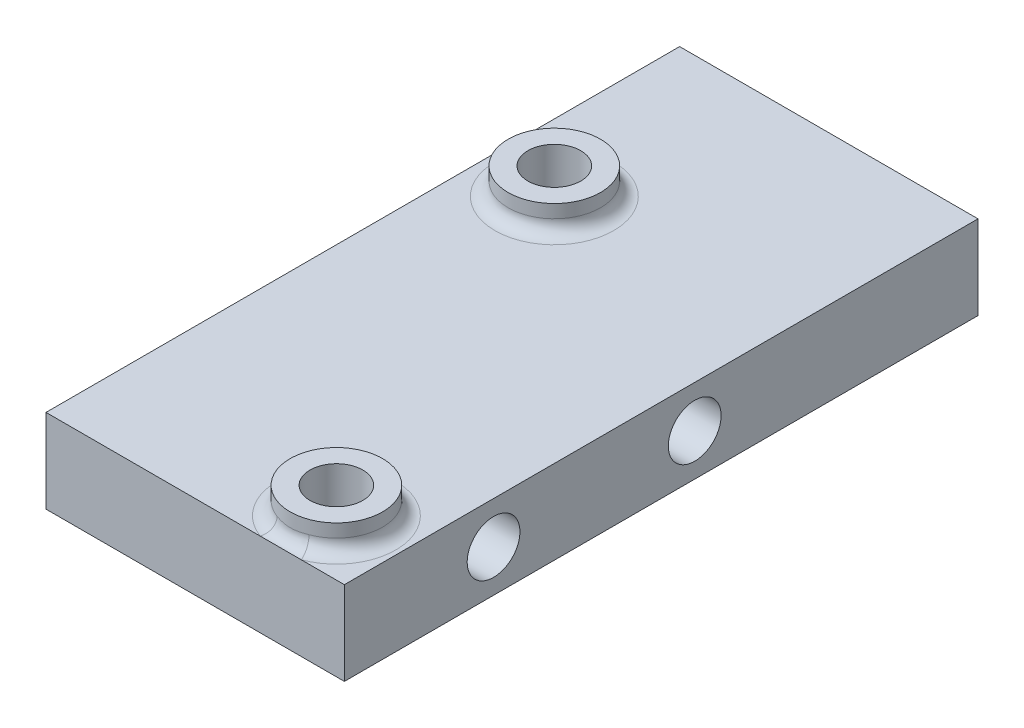
ISO-10303-21;
HEADER;
FILE_DESCRIPTION(('STEP AP214'),'2;1');
FILE_NAME('part.step','',(''),(''),'','','');
FILE_SCHEMA(('AUTOMOTIVE_DESIGN { 1 0 10303 214 1 1 1 1 }'));
ENDSEC;
DATA;
#1=APPLICATION_CONTEXT('core data for automotive mechanical design processes');
#2=APPLICATION_PROTOCOL_DEFINITION('international standard','automotive_design',2000,#1);
#3=PRODUCT_CONTEXT('',#1,'mechanical');
#4=PRODUCT('Part','Part','',(#3));
#5=PRODUCT_RELATED_PRODUCT_CATEGORY('part','',(#4));
#6=PRODUCT_DEFINITION_FORMATION('','',#4);
#7=PRODUCT_DEFINITION_CONTEXT('part definition',#1,'design');
#8=PRODUCT_DEFINITION('design','',#6,#7);
#9=PRODUCT_DEFINITION_SHAPE('','',#8);
#10=(LENGTH_UNIT() NAMED_UNIT(*) SI_UNIT(.MILLI.,.METRE.));
#11=(NAMED_UNIT(*) PLANE_ANGLE_UNIT() SI_UNIT($,.RADIAN.));
#12=(NAMED_UNIT(*) SI_UNIT($,.STERADIAN.) SOLID_ANGLE_UNIT());
#13=UNCERTAINTY_MEASURE_WITH_UNIT(LENGTH_MEASURE(1.E-05),#10,'distance_accuracy_value','');
#14=(GEOMETRIC_REPRESENTATION_CONTEXT(3) GLOBAL_UNCERTAINTY_ASSIGNED_CONTEXT((#13)) GLOBAL_UNIT_ASSIGNED_CONTEXT((#10,
#11,#12)) REPRESENTATION_CONTEXT('',''));
#15=CARTESIAN_POINT('',(0.,0.,0.));
#16=DIRECTION('',(0.,0.,1.));
#17=DIRECTION('',(1.,0.,0.));
#18=AXIS2_PLACEMENT_3D('',#15,#16,#17);
#19=CARTESIAN_POINT('',(0.,6.35,0.));
#20=DIRECTION('',(0.,1.,0.));
#21=DIRECTION('',(0.,0.,1.));
#22=AXIS2_PLACEMENT_3D('',#19,#20,#21);
#23=PLANE('',#22);
#24=CARTESIAN_POINT('',(5.207,6.35,-33.55975));
#25=DIRECTION('',(0.,1.,0.));
#26=DIRECTION('',(0.,0.,1.));
#27=AXIS2_PLACEMENT_3D('',#24,#25,#26);
#28=CIRCLE('',#27,4.5);
#29=CARTESIAN_POINT('',(5.207,6.35,-29.05975));
#30=VERTEX_POINT('',#29);
#31=EDGE_CURVE('E168',#30,#30,#28,.F.);
#32=ORIENTED_EDGE('',*,*,#31,.T.);
#33=EDGE_LOOP('',(#32));
#34=FACE_BOUND('',#33,.T.);
#35=DIRECTION('',(1.,0.,0.));
#36=VECTOR('',#35,1.);
#37=CARTESIAN_POINT('',(0.,6.35,-0.127));
#38=LINE('',#37,#36);
#39=CARTESIAN_POINT('',(0.127,6.35,-0.127));
#40=VERTEX_POINT('',#39);
#41=CARTESIAN_POINT('',(16.351885072575,6.35,-0.127));
#42=VERTEX_POINT('',#41);
#43=EDGE_CURVE('E121',#40,#42,#38,.T.);
#44=ORIENTED_EDGE('',*,*,#43,.T.);
#45=CARTESIAN_POINT('',(17.907,6.35,-4.34975));
#46=DIRECTION('',(0.,1.,0.));
#47=DIRECTION('',(0.,0.,1.));
#48=AXIS2_PLACEMENT_3D('',#45,#46,#47);
#49=CIRCLE('',#48,4.5);
#50=CARTESIAN_POINT('',(19.462114927425,6.35,-0.127));
#51=VERTEX_POINT('',#50);
#52=EDGE_CURVE('E60',#42,#51,#49,.F.);
#53=ORIENTED_EDGE('',*,*,#52,.T.);
#54=CARTESIAN_POINT('',(22.733,6.35,-0.127));
#55=VERTEX_POINT('',#54);
#56=EDGE_CURVE('E126',#51,#55,#38,.T.);
#57=ORIENTED_EDGE('',*,*,#56,.T.);
#58=DIRECTION('',(0.,0.,-1.));
#59=VECTOR('',#58,1.);
#60=CARTESIAN_POINT('',(22.733,6.35,0.));
#61=LINE('',#60,#59);
#62=CARTESIAN_POINT('',(22.733,6.35,-48.133));
#63=VERTEX_POINT('',#62);
#64=EDGE_CURVE('E124',#55,#63,#61,.T.);
#65=ORIENTED_EDGE('',*,*,#64,.T.);
#66=DIRECTION('',(1.,0.,0.));
#67=VECTOR('',#66,1.);
#68=CARTESIAN_POINT('',(0.,6.35,-48.133));
#69=LINE('',#68,#67);
#70=CARTESIAN_POINT('',(0.126999999999991,6.35,-48.133));
#71=VERTEX_POINT('',#70);
#72=EDGE_CURVE('E128',#71,#63,#69,.T.);
#73=ORIENTED_EDGE('',*,*,#72,.F.);
#74=DIRECTION('',(0.,0.,-1.));
#75=VECTOR('',#74,1.);
#76=CARTESIAN_POINT('',(0.127,6.35,0.));
#77=LINE('',#76,#75);
#78=EDGE_CURVE('E111',#40,#71,#77,.T.);
#79=ORIENTED_EDGE('',*,*,#78,.F.);
#80=EDGE_LOOP('',(#44,#53,#57,#65,#73,#79));
#81=FACE_BOUND('',#80,.T.);
#82=ADVANCED_FACE('F45',(#34,#81),#23,.T.);
#83=CARTESIAN_POINT('',(0.127,6.35,0.));
#84=DIRECTION('',(-1.,0.,0.));
#85=DIRECTION('',(0.,0.,1.));
#86=AXIS2_PLACEMENT_3D('',#83,#84,#85);
#87=PLANE('',#86);
#88=CARTESIAN_POINT('',(0.126999999999995,3.175,-26.67));
#89=DIRECTION('',(-1.,0.,0.));
#90=DIRECTION('',(0.,0.,1.));
#91=AXIS2_PLACEMENT_3D('',#88,#89,#90);
#92=CIRCLE('',#91,2.);
#93=CARTESIAN_POINT('',(0.126999999999996,3.175,-24.67));
#94=VERTEX_POINT('',#93);
#95=EDGE_CURVE('E224',#94,#94,#92,.T.);
#96=ORIENTED_EDGE('',*,*,#95,.F.);
#97=EDGE_LOOP('',(#96));
#98=FACE_BOUND('',#97,.T.);
#99=CARTESIAN_POINT('',(0.126999999999998,3.175,-11.43));
#100=DIRECTION('',(-1.,0.,0.));
#101=DIRECTION('',(0.,0.,1.));
#102=AXIS2_PLACEMENT_3D('',#99,#100,#101);
#103=CIRCLE('',#102,2.);
#104=CARTESIAN_POINT('',(0.126999999999998,3.175,-9.43));
#105=VERTEX_POINT('',#104);
#106=EDGE_CURVE('E216',#105,#105,#103,.T.);
#107=ORIENTED_EDGE('',*,*,#106,.F.);
#108=EDGE_LOOP('',(#107));
#109=FACE_BOUND('',#108,.T.);
#110=DIRECTION('',(0.,0.,-1.));
#111=VECTOR('',#110,1.);
#112=CARTESIAN_POINT('',(0.127,0.,0.));
#113=LINE('',#112,#111);
#114=CARTESIAN_POINT('',(0.127,0.,-0.127));
#115=VERTEX_POINT('',#114);
#116=CARTESIAN_POINT('',(0.126999999999991,0.,-48.133));
#117=VERTEX_POINT('',#116);
#118=EDGE_CURVE('E114',#115,#117,#113,.T.);
#119=ORIENTED_EDGE('',*,*,#118,.F.);
#120=DIRECTION('',(0.,-1.,0.));
#121=VECTOR('',#120,1.);
#122=CARTESIAN_POINT('',(0.127,6.35,-0.127));
#123=LINE('',#122,#121);
#124=EDGE_CURVE('E107',#40,#115,#123,.T.);
#125=ORIENTED_EDGE('',*,*,#124,.F.);
#126=ORIENTED_EDGE('',*,*,#78,.T.);
#127=DIRECTION('',(0.,-1.,0.));
#128=VECTOR('',#127,1.);
#129=CARTESIAN_POINT('',(0.126999999999991,6.35,-48.133));
#130=LINE('',#129,#128);
#131=EDGE_CURVE('E140',#71,#117,#130,.T.);
#132=ORIENTED_EDGE('',*,*,#131,.T.);
#133=EDGE_LOOP('',(#119,#125,#126,#132));
#134=FACE_BOUND('',#133,.T.);
#135=ADVANCED_FACE('F109',(#98,#109,#134),#87,.T.);
#136=CARTESIAN_POINT('',(0.,6.35,-0.127));
#137=DIRECTION('',(0.,0.,-1.));
#138=DIRECTION('',(-1.,0.,0.));
#139=AXIS2_PLACEMENT_3D('',#136,#137,#138);
#140=PLANE('',#139);
#141=DIRECTION('',(1.,0.,0.));
#142=VECTOR('',#141,1.);
#143=CARTESIAN_POINT('',(0.,0.,-0.127));
#144=LINE('',#143,#142);
#145=CARTESIAN_POINT('',(22.733,0.,-0.127));
#146=VERTEX_POINT('',#145);
#147=EDGE_CURVE('E142',#115,#146,#144,.T.);
#148=ORIENTED_EDGE('',*,*,#147,.T.);
#149=DIRECTION('',(0.,-1.,0.));
#150=VECTOR('',#149,1.);
#151=CARTESIAN_POINT('',(22.733,6.35,-0.127));
#152=LINE('',#151,#150);
#153=EDGE_CURVE('E118',#55,#146,#152,.T.);
#154=ORIENTED_EDGE('',*,*,#153,.F.);
#155=ORIENTED_EDGE('',*,*,#56,.F.);
#156=EDGE_CURVE('E123',#42,#51,#38,.T.);
#157=ORIENTED_EDGE('',*,*,#156,.F.);
#158=ORIENTED_EDGE('',*,*,#43,.F.);
#159=ORIENTED_EDGE('',*,*,#124,.T.);
#160=EDGE_LOOP('',(#148,#154,#155,#157,#158,#159));
#161=FACE_BOUND('',#160,.T.);
#162=ADVANCED_FACE('F122',(#161),#140,.F.);
#163=CARTESIAN_POINT('',(22.733,6.35,0.));
#164=DIRECTION('',(-1.,0.,0.));
#165=DIRECTION('',(0.,0.,1.));
#166=AXIS2_PLACEMENT_3D('',#163,#164,#165);
#167=PLANE('',#166);
#168=CARTESIAN_POINT('',(22.733,3.175,-26.67));
#169=DIRECTION('',(-1.,0.,0.));
#170=DIRECTION('',(0.,0.,1.));
#171=AXIS2_PLACEMENT_3D('',#168,#169,#170);
#172=CIRCLE('',#171,2.);
#173=CARTESIAN_POINT('',(22.733,3.175,-24.67));
#174=VERTEX_POINT('',#173);
#175=EDGE_CURVE('E143',#174,#174,#172,.T.);
#176=ORIENTED_EDGE('',*,*,#175,.T.);
#177=EDGE_LOOP('',(#176));
#178=FACE_BOUND('',#177,.T.);
#179=CARTESIAN_POINT('',(22.733,3.175,-11.43));
#180=DIRECTION('',(-1.,0.,0.));
#181=DIRECTION('',(0.,0.,1.));
#182=AXIS2_PLACEMENT_3D('',#179,#180,#181);
#183=CIRCLE('',#182,2.);
#184=CARTESIAN_POINT('',(22.733,3.175,-9.43000000000001));
#185=VERTEX_POINT('',#184);
#186=EDGE_CURVE('E135',#185,#185,#183,.T.);
#187=ORIENTED_EDGE('',*,*,#186,.T.);
#188=EDGE_LOOP('',(#187));
#189=FACE_BOUND('',#188,.T.);
#190=DIRECTION('',(0.,0.,-1.));
#191=VECTOR('',#190,1.);
#192=CARTESIAN_POINT('',(22.733,0.,0.));
#193=LINE('',#192,#191);
#194=CARTESIAN_POINT('',(22.733,0.,-48.133));
#195=VERTEX_POINT('',#194);
#196=EDGE_CURVE('E145',#146,#195,#193,.T.);
#197=ORIENTED_EDGE('',*,*,#196,.T.);
#198=DIRECTION('',(0.,-1.,0.));
#199=VECTOR('',#198,1.);
#200=CARTESIAN_POINT('',(22.733,6.35,-48.133));
#201=LINE('',#200,#199);
#202=EDGE_CURVE('E154',#63,#195,#201,.T.);
#203=ORIENTED_EDGE('',*,*,#202,.F.);
#204=ORIENTED_EDGE('',*,*,#64,.F.);
#205=ORIENTED_EDGE('',*,*,#153,.T.);
#206=EDGE_LOOP('',(#197,#203,#204,#205));
#207=FACE_BOUND('',#206,.T.);
#208=ADVANCED_FACE('F238',(#178,#189,#207),#167,.F.);
#209=CARTESIAN_POINT('',(17.907,6.35,-4.34975));
#210=DIRECTION('',(0.,-1.,0.));
#211=DIRECTION('',(0.,0.,-1.));
#212=AXIS2_PLACEMENT_3D('',#209,#210,#211);
#213=CYLINDRICAL_SURFACE('',#212,2.);
#214=CARTESIAN_POINT('',(17.907,0.,-4.34975));
#215=DIRECTION('',(0.,1.,0.));
#216=DIRECTION('',(0.,0.,1.));
#217=AXIS2_PLACEMENT_3D('',#214,#215,#216);
#218=CIRCLE('',#217,2.);
#219=CARTESIAN_POINT('',(17.907,0.,-2.34975));
#220=VERTEX_POINT('',#219);
#221=EDGE_CURVE('E132',#220,#220,#218,.T.);
#222=ORIENTED_EDGE('',*,*,#221,.F.);
#223=EDGE_LOOP('',(#222));
#224=FACE_BOUND('',#223,.T.);
#225=CARTESIAN_POINT('',(17.907,8.35,-4.34975));
#226=DIRECTION('',(0.,1.,0.));
#227=DIRECTION('',(0.,0.,1.));
#228=AXIS2_PLACEMENT_3D('',#225,#226,#227);
#229=CIRCLE('',#228,2.);
#230=CARTESIAN_POINT('',(17.907,8.35,-2.34975));
#231=VERTEX_POINT('',#230);
#232=EDGE_CURVE('E218',#231,#231,#229,.T.);
#233=ORIENTED_EDGE('',*,*,#232,.T.);
#234=EDGE_LOOP('',(#233));
#235=FACE_BOUND('',#234,.T.);
#236=ADVANCED_FACE('F268',(#224,#235),#213,.F.);
#237=CARTESIAN_POINT('',(0.,6.35,-48.133));
#238=DIRECTION('',(0.,0.,-1.));
#239=DIRECTION('',(-1.,0.,0.));
#240=AXIS2_PLACEMENT_3D('',#237,#238,#239);
#241=PLANE('',#240);
#242=DIRECTION('',(1.,0.,0.));
#243=VECTOR('',#242,1.);
#244=CARTESIAN_POINT('',(0.,0.,-48.133));
#245=LINE('',#244,#243);
#246=EDGE_CURVE('E148',#117,#195,#245,.T.);
#247=ORIENTED_EDGE('',*,*,#246,.F.);
#248=ORIENTED_EDGE('',*,*,#131,.F.);
#249=ORIENTED_EDGE('',*,*,#72,.T.);
#250=ORIENTED_EDGE('',*,*,#202,.T.);
#251=EDGE_LOOP('',(#247,#248,#249,#250));
#252=FACE_BOUND('',#251,.T.);
#253=ADVANCED_FACE('F269',(#252),#241,.T.);
#254=CARTESIAN_POINT('',(5.207,6.35,-33.55975));
#255=DIRECTION('',(0.,-1.,0.));
#256=DIRECTION('',(0.,0.,-1.));
#257=AXIS2_PLACEMENT_3D('',#254,#255,#256);
#258=CYLINDRICAL_SURFACE('',#257,2.);
#259=CARTESIAN_POINT('',(5.207,0.,-33.55975));
#260=DIRECTION('',(0.,1.,0.));
#261=DIRECTION('',(0.,0.,1.));
#262=AXIS2_PLACEMENT_3D('',#259,#260,#261);
#263=CIRCLE('',#262,2.);
#264=CARTESIAN_POINT('',(5.207,0.,-31.55975));
#265=VERTEX_POINT('',#264);
#266=EDGE_CURVE('E129',#265,#265,#263,.T.);
#267=ORIENTED_EDGE('',*,*,#266,.F.);
#268=EDGE_LOOP('',(#267));
#269=FACE_BOUND('',#268,.T.);
#270=CARTESIAN_POINT('',(5.207,8.35,-33.55975));
#271=DIRECTION('',(0.,1.,0.));
#272=DIRECTION('',(0.,0.,1.));
#273=AXIS2_PLACEMENT_3D('',#270,#271,#272);
#274=CIRCLE('',#273,2.);
#275=CARTESIAN_POINT('',(5.207,8.35,-31.55975));
#276=VERTEX_POINT('',#275);
#277=EDGE_CURVE('E213',#276,#276,#274,.T.);
#278=ORIENTED_EDGE('',*,*,#277,.T.);
#279=EDGE_LOOP('',(#278));
#280=FACE_BOUND('',#279,.T.);
#281=ADVANCED_FACE('F276',(#269,#280),#258,.F.);
#282=CARTESIAN_POINT('',(0.,0.,0.));
#283=DIRECTION('',(0.,1.,0.));
#284=DIRECTION('',(0.,0.,1.));
#285=AXIS2_PLACEMENT_3D('',#282,#283,#284);
#286=PLANE('',#285);
#287=ORIENTED_EDGE('',*,*,#118,.T.);
#288=ORIENTED_EDGE('',*,*,#246,.T.);
#289=ORIENTED_EDGE('',*,*,#196,.F.);
#290=ORIENTED_EDGE('',*,*,#147,.F.);
#291=EDGE_LOOP('',(#287,#288,#289,#290));
#292=FACE_BOUND('',#291,.T.);
#293=ORIENTED_EDGE('',*,*,#221,.T.);
#294=EDGE_LOOP('',(#293));
#295=FACE_BOUND('',#294,.T.);
#296=ORIENTED_EDGE('',*,*,#266,.T.);
#297=EDGE_LOOP('',(#296));
#298=FACE_BOUND('',#297,.T.);
#299=ADVANCED_FACE('F252',(#292,#295,#298),#286,.F.);
#300=CARTESIAN_POINT('',(22.733,3.175,-11.43));
#301=DIRECTION('',(-1.,0.,0.));
#302=DIRECTION('',(0.,0.,1.));
#303=AXIS2_PLACEMENT_3D('',#300,#301,#302);
#304=CYLINDRICAL_SURFACE('',#303,2.);
#305=ORIENTED_EDGE('',*,*,#186,.F.);
#306=EDGE_LOOP('',(#305));
#307=FACE_BOUND('',#306,.T.);
#308=ORIENTED_EDGE('',*,*,#106,.T.);
#309=EDGE_LOOP('',(#308));
#310=FACE_BOUND('',#309,.T.);
#311=ADVANCED_FACE('F229',(#307,#310),#304,.F.);
#312=CARTESIAN_POINT('',(22.733,3.175,-26.67));
#313=DIRECTION('',(-1.,0.,0.));
#314=DIRECTION('',(0.,0.,1.));
#315=AXIS2_PLACEMENT_3D('',#312,#313,#314);
#316=CYLINDRICAL_SURFACE('',#315,2.);
#317=ORIENTED_EDGE('',*,*,#175,.F.);
#318=EDGE_LOOP('',(#317));
#319=FACE_BOUND('',#318,.T.);
#320=ORIENTED_EDGE('',*,*,#95,.T.);
#321=EDGE_LOOP('',(#320));
#322=FACE_BOUND('',#321,.T.);
#323=ADVANCED_FACE('F242',(#319,#322),#316,.F.);
#324=CARTESIAN_POINT('',(5.207,8.35,-33.55975));
#325=DIRECTION('',(0.,1.,0.));
#326=DIRECTION('',(0.,0.,1.));
#327=AXIS2_PLACEMENT_3D('',#324,#325,#326);
#328=PLANE('',#327);
#329=CARTESIAN_POINT('',(5.207,8.35,-33.55975));
#330=DIRECTION('',(0.,1.,0.));
#331=DIRECTION('',(0.,0.,1.));
#332=AXIS2_PLACEMENT_3D('',#329,#330,#331);
#333=CIRCLE('',#332,3.5);
#334=CARTESIAN_POINT('',(5.207,8.35,-30.05975));
#335=VERTEX_POINT('',#334);
#336=EDGE_CURVE('E211',#335,#335,#333,.T.);
#337=ORIENTED_EDGE('',*,*,#336,.T.);
#338=EDGE_LOOP('',(#337));
#339=FACE_BOUND('',#338,.T.);
#340=ORIENTED_EDGE('',*,*,#277,.F.);
#341=EDGE_LOOP('',(#340));
#342=FACE_BOUND('',#341,.T.);
#343=ADVANCED_FACE('F207',(#339,#342),#328,.T.);
#344=CARTESIAN_POINT('',(5.207,8.35,-33.55975));
#345=DIRECTION('',(0.,-1.,0.));
#346=DIRECTION('',(0.,0.,-1.));
#347=AXIS2_PLACEMENT_3D('',#344,#345,#346);
#348=CYLINDRICAL_SURFACE('',#347,3.5);
#349=CARTESIAN_POINT('',(5.207,7.35,-33.55975));
#350=DIRECTION('',(0.,1.,0.));
#351=DIRECTION('',(0.,0.,1.));
#352=AXIS2_PLACEMENT_3D('',#349,#350,#351);
#353=CIRCLE('',#352,3.5);
#354=CARTESIAN_POINT('',(5.207,7.35,-30.05975));
#355=VERTEX_POINT('',#354);
#356=EDGE_CURVE('E11',#355,#355,#353,.T.);
#357=ORIENTED_EDGE('',*,*,#356,.T.);
#358=EDGE_LOOP('',(#357));
#359=FACE_BOUND('',#358,.T.);
#360=ORIENTED_EDGE('',*,*,#336,.F.);
#361=EDGE_LOOP('',(#360));
#362=FACE_BOUND('',#361,.T.);
#363=ADVANCED_FACE('F203',(#359,#362),#348,.T.);
#364=CARTESIAN_POINT('',(17.907,8.35,-4.34975));
#365=DIRECTION('',(0.,1.,0.));
#366=DIRECTION('',(0.,0.,1.));
#367=AXIS2_PLACEMENT_3D('',#364,#365,#366);
#368=PLANE('',#367);
#369=CARTESIAN_POINT('',(17.907,8.35,-4.34975));
#370=DIRECTION('',(0.,1.,0.));
#371=DIRECTION('',(0.,0.,1.));
#372=AXIS2_PLACEMENT_3D('',#369,#370,#371);
#373=CIRCLE('',#372,3.5);
#374=CARTESIAN_POINT('',(17.907,8.35,-0.849749999999997));
#375=VERTEX_POINT('',#374);
#376=EDGE_CURVE('E193',#375,#375,#373,.T.);
#377=ORIENTED_EDGE('',*,*,#376,.T.);
#378=EDGE_LOOP('',(#377));
#379=FACE_BOUND('',#378,.T.);
#380=ORIENTED_EDGE('',*,*,#232,.F.);
#381=EDGE_LOOP('',(#380));
#382=FACE_BOUND('',#381,.T.);
#383=ADVANCED_FACE('F206',(#379,#382),#368,.T.);
#384=CARTESIAN_POINT('',(17.907,8.35,-4.34975));
#385=DIRECTION('',(0.,-1.,0.));
#386=DIRECTION('',(0.,0.,-1.));
#387=AXIS2_PLACEMENT_3D('',#384,#385,#386);
#388=CYLINDRICAL_SURFACE('',#387,3.5);
#389=CARTESIAN_POINT('',(17.907,7.35,-4.34975));
#390=DIRECTION('',(0.,1.,0.));
#391=DIRECTION('',(0.,0.,1.));
#392=AXIS2_PLACEMENT_3D('',#389,#390,#391);
#393=CIRCLE('',#392,3.5);
#394=CARTESIAN_POINT('',(19.1165338324417,7.35,-1.06538888888889));
#395=VERTEX_POINT('',#394);
#396=CARTESIAN_POINT('',(16.6974661675583,7.35,-1.06538888888889));
#397=VERTEX_POINT('',#396);
#398=EDGE_CURVE('E117',#395,#397,#393,.T.);
#399=ORIENTED_EDGE('',*,*,#398,.T.);
#400=CARTESIAN_POINT('',(15.999697926745,7.24321872944896,-1.41509519894464));
#401=CARTESIAN_POINT('',(16.3294576607969,5.80948965724298,-1.2007764912701));
#402=CARTESIAN_POINT('',(15.4547544772436,6.35,-0.127));
#403=CARTESIAN_POINT('',(16.0433975283235,7.26155633603338,-1.38667642643534));
#404=CARTESIAN_POINT('',(16.3277106847959,5.85961918437073,-1.2086767850074));
#405=CARTESIAN_POINT('',(15.5109396791709,6.35,-0.127));
#406=CARTESIAN_POINT('',(16.0882379079662,7.27676005500093,-1.35893893439116));
#407=CARTESIAN_POINT('',(16.3337968310106,5.90877428258155,-1.21022918435183));
#408=CARTESIAN_POINT('',(15.5685915958453,6.35,-0.127));
#409=CARTESIAN_POINT('',(16.1796763203547,7.3019900220726,-1.30522546163517));
#410=CARTESIAN_POINT('',(16.3588848129907,6.00089432264958,-1.20419366238499));
#411=CARTESIAN_POINT('',(15.6861552689582,6.35,-0.127));
#412=CARTESIAN_POINT('',(16.2262698186064,7.31202875808702,-1.27924536537503));
#413=CARTESIAN_POINT('',(16.3774047065049,6.04420056046997,-1.19695922064592));
#414=CARTESIAN_POINT('',(15.7460611953328,6.35,-0.127));
#415=CARTESIAN_POINT('',(16.3206022029555,7.32804552092679,-1.22946512411143));
#416=CARTESIAN_POINT('',(16.4241427483341,6.12350666537659,-1.177264720906));
#417=CARTESIAN_POINT('',(15.8673456895324,6.35,-0.127));
#418=CARTESIAN_POINT('',(16.3683317816887,7.33404927937305,-1.2056520191199));
#419=CARTESIAN_POINT('',(16.4520350369096,6.15987474404767,-1.16498612475311));
#420=CARTESIAN_POINT('',(15.9287122907468,6.35,-0.127));
#421=CARTESIAN_POINT('',(16.4650023992085,7.34299012276124,-1.16015780249474));
#422=CARTESIAN_POINT('',(16.5152283263764,6.2260658127033,-1.13775889322251));
#423=CARTESIAN_POINT('',(16.0530030846908,6.35,-0.127));
#424=CARTESIAN_POINT('',(16.5139443818133,7.3459247364343,-1.13847842163442));
#425=CARTESIAN_POINT('',(16.5504092350124,6.25616254868961,-1.12284741984191));
#426=CARTESIAN_POINT('',(16.1159284909008,6.35,-0.127));
#427=CARTESIAN_POINT('',(16.649249127931,7.35082748837113,-1.08222712208977));
#428=CARTESIAN_POINT('',(16.653512220511,6.32970705651208,-1.08124457847469));
#429=CARTESIAN_POINT('',(16.2898917359147,6.35,-0.127));
#430=CARTESIAN_POINT('',(16.7366122759026,7.35049011088717,-1.04992620515135));
#431=CARTESIAN_POINT('',(16.7280006549486,6.368745571691,-1.05320476940297));
#432=CARTESIAN_POINT('',(16.4022157833042,6.35,-0.127));
#433=CARTESIAN_POINT('',(16.9135828006579,7.34627409552643,-0.992401102045088));
#434=CARTESIAN_POINT('',(16.8877770893521,6.43261282671311,-1.00032532935642));
#435=CARTESIAN_POINT('',(16.6297493151305,6.35,-0.127));
#436=CARTESIAN_POINT('',(17.0031910558094,7.34239404990394,-0.967179734278355));
#437=CARTESIAN_POINT('',(16.9733617913917,6.45816036139918,-0.975168037422289));
#438=CARTESIAN_POINT('',(16.7449599288976,6.35,-0.127));
#439=CARTESIAN_POINT('',(17.1844150701297,7.33371531003257,-0.923881160468167));
#440=CARTESIAN_POINT('',(17.1515023314267,6.49892667923025,-0.930901480346923));
#441=CARTESIAN_POINT('',(16.9779622330241,6.35,-0.127));
#442=CARTESIAN_POINT('',(17.2760366271477,7.32891353199229,-0.905828579093276));
#443=CARTESIAN_POINT('',(17.244640321304,6.51452413389724,-0.911487401873235));
#444=CARTESIAN_POINT('',(17.0957613777613,6.35,-0.127));
#445=CARTESIAN_POINT('',(17.4604424482232,7.32044074537923,-0.877100835900574));
#446=CARTESIAN_POINT('',(17.4346345868489,6.53805942666349,-0.880365706393962));
#447=CARTESIAN_POINT('',(17.3328545762868,6.35,-0.127));
#448=CARTESIAN_POINT('',(17.5532264569583,7.31676949287541,-0.866424081997488));
#449=CARTESIAN_POINT('',(17.5321865230427,6.54621088469009,-0.868413626543086));
#450=CARTESIAN_POINT('',(17.4521483018035,6.35,-0.127));
#451=CARTESIAN_POINT('',(17.7422140396949,7.31179018382034,-0.852309204932778));
#452=CARTESIAN_POINT('',(17.7315386979432,6.55674033265935,-0.852679067246822));
#453=CARTESIAN_POINT('',(17.6951323367506,6.35,-0.127));
#454=CARTESIAN_POINT('',(17.838436142061,7.31055698552848,-0.849099857322103));
#455=CARTESIAN_POINT('',(17.834232927626,6.55902893966175,-0.849019727085348));
#456=CARTESIAN_POINT('',(17.8188464683642,6.35,-0.127));
#457=CARTESIAN_POINT('',(18.0308195447798,7.31111953102721,-0.850618231134204));
#458=CARTESIAN_POINT('',(18.0385311221073,6.55792959830373,-0.850726094075816));
#459=CARTESIAN_POINT('',(18.0661965575739,6.35,-0.127));
#460=CARTESIAN_POINT('',(18.1269808392668,7.31291553237697,-0.855346627467324));
#461=CARTESIAN_POINT('',(18.1410032712376,6.554531869191,-0.856107175094256));
#462=CARTESIAN_POINT('',(18.1898325076286,6.35,-0.127));
#463=CARTESIAN_POINT('',(18.3184620483269,7.31889057201906,-0.872691554377935));
#464=CARTESIAN_POINT('',(18.3423628262768,6.54141108734868,-0.875370703909162));
#465=CARTESIAN_POINT('',(18.4360226335632,6.35,-0.127));
#466=CARTESIAN_POINT('',(18.4137825494985,7.32306778892083,-0.885302056647016));
#467=CARTESIAN_POINT('',(18.4420849593019,6.53157679651971,-0.889409662002608));
#468=CARTESIAN_POINT('',(18.5585775636411,6.35,-0.127));
#469=CARTESIAN_POINT('',(18.6030465951768,7.33219842827542,-0.918314965176124));
#470=CARTESIAN_POINT('',(18.6354814803517,6.50375232645859,-0.924816771487348));
#471=CARTESIAN_POINT('',(18.8019170509416,6.35,-0.127));
#472=CARTESIAN_POINT('',(18.6969901244687,7.33715185929795,-0.938717457466353));
#473=CARTESIAN_POINT('',(18.7298886133038,6.48548949782955,-0.946475378269153));
#474=CARTESIAN_POINT('',(18.9227015886021,6.35,-0.127));
#475=CARTESIAN_POINT('',(18.8577696618529,7.3443073678771,-0.980632871330693));
#476=CARTESIAN_POINT('',(18.8846443465066,6.44454445974384,-0.988250953538482));
#477=CARTESIAN_POINT('',(19.1294181366684,6.35,-0.127));
#478=CARTESIAN_POINT('',(18.925066999975,7.34689123480087,-1.00035390721988));
#479=CARTESIAN_POINT('',(18.9479707045128,6.42404459090778,-1.00747943116209));
#480=CARTESIAN_POINT('',(19.2159432856834,6.35,-0.127));
#481=CARTESIAN_POINT('',(19.0583449490239,7.35000523285223,-1.04379848382673));
#482=CARTESIAN_POINT('',(19.0681436278302,6.37574965221625,-1.04734161374027));
#483=CARTESIAN_POINT('',(19.387300648744,6.35,-0.127));
#484=CARTESIAN_POINT('',(19.12432641309,7.35053674073197,-1.06751933026192));
#485=CARTESIAN_POINT('',(19.1251175136652,6.34765057523598,-1.06810834099442));
#486=CARTESIAN_POINT('',(19.4721339596831,6.35,-0.127));
#487=CARTESIAN_POINT('',(19.2547574753592,7.34818383042843,-1.11889041714433));
#488=CARTESIAN_POINT('',(19.2303986466411,6.28252499742807,-1.10901077085189));
#489=CARTESIAN_POINT('',(19.6398310397517,6.35,-0.127));
#490=CARTESIAN_POINT('',(19.3192065354104,7.34529822977911,-1.14654201488563));
#491=CARTESIAN_POINT('',(19.2786803261878,6.24504352887782,-1.12922668792604));
#492=CARTESIAN_POINT('',(19.7226941169717,6.35,-0.127));
#493=CARTESIAN_POINT('',(19.4462267893442,7.33434856340773,-1.20559306318015));
#494=CARTESIAN_POINT('',(19.3634393064996,6.16005038598769,-1.16550955239314));
#495=CARTESIAN_POINT('',(19.8860058720387,6.35,-0.127));
#496=CARTESIAN_POINT('',(19.5087941322648,7.32627454652852,-1.23699962116552));
#497=CARTESIAN_POINT('',(19.3996268087809,6.11191555369393,-1.18149022656211));
#498=CARTESIAN_POINT('',(19.9664495986489,6.35,-0.127));
#499=CARTESIAN_POINT('',(19.5701341720201,7.31472651756466,-1.27014211491805));
#500=CARTESIAN_POINT('',(19.4268844482308,6.05917029230527,-1.19278047679505));
#501=CARTESIAN_POINT('',(20.0453153640259,6.35,-0.127));
#502=(BOUNDED_SURFACE() B_SPLINE_SURFACE(3,2,((#400,#401,#402),(#403,#404,#405),(#406,#407,
#408),(#409,#410,#411),(#412,#413,#414),(#415,#416,#417),(#418,#419,#420),(#421,#422,#423),
(#424,#425,#426),(#427,#428,#429),(#430,#431,#432),(#433,#434,#435),(#436,#437,#438),(#439,#440,
#441),(#442,#443,#444),(#445,#446,#447),(#448,#449,#450),(#451,#452,#453),(#454,#455,#456),
(#457,#458,#459),(#460,#461,#462),(#463,#464,#465),(#466,#467,#468),(#469,#470,#471),(#472,#473,
#474),(#475,#476,#477),(#478,#479,#480),(#481,#482,#483),(#484,#485,#486),(#487,#488,#489),
(#490,#491,#492),(#493,#494,#495),(#496,#497,#498),(#499,#500,#501)),.UNSPECIFIED.,.F.,.F.,
.F.) B_SPLINE_SURFACE_WITH_KNOTS((4,2,2,2,2,2,2,2,2,2,2,2,2,2,2,2,4),(3,3),(0.,0.20821691135999,
0.415928001170756,0.622301590262654,0.828841223294626,1.18757059768189,1.54644258199076,
1.90653683840273,2.26655334353245,2.63746204075806,3.00840227626423,3.37905915975946,
3.7497201357405,4.02015823831583,4.29041489555097,4.56076510051026,4.83163537933101),(0.,1.),
.UNSPECIFIED.) GEOMETRIC_REPRESENTATION_ITEM() RATIONAL_B_SPLINE_SURFACE(((1.,0.55812357427877,
1.),(1.,0.570211370652609,1.),(1.,0.582015158644806,1.),(1.,0.604881797062378,1.),(1.,
0.615946377788026,1.),(1.,0.637153315191357,1.),(1.,0.647301151508176,1.),(1.,0.666692749897821,
1.),(1.,0.675935778001946,1.),(1.,0.699922891851844,1.),(1.,0.713701909196002,1.),(1.,
0.738245906511543,1.),(1.,0.74900968609945,1.),(1.,0.767490582752307,1.),(1.,0.775197198414698,
1.),(1.,0.787461836987169,1.),(1.,0.792020539379748,1.),(1.,0.798047346417469,1.),(1.,
0.799417773154062,1.),(1.,0.79876942913823,1.),(1.,0.796750370193219,1.),(1.,0.789344522619726,
1.),(1.,0.783960307694239,1.),(1.,0.769866834432096,1.),(1.,0.761157539383726,1.),(1.,
0.743268477379644,1.),(1.,0.734852662367328,1.),(1.,0.716316454926664,1.),(1.,0.706197209940725,
1.),(1.,0.684287771133281,1.),(1.,0.672497000135282,1.),(1.,0.647325807639013,1.),(1.,
0.633942371756562,1.),(1.,0.619824912006087,1.))) REPRESENTATION_ITEM('') SURFACE());
#503=CARTESIAN_POINT('',(15.999697926745,7.24321872944896,-1.41509519894464));
#504=CARTESIAN_POINT('',(16.0433975283235,7.26155633603338,-1.38667642643534));
#505=CARTESIAN_POINT('',(16.0882379079662,7.27676005500093,-1.35893893439116));
#506=CARTESIAN_POINT('',(16.1796763203547,7.3019900220726,-1.30522546163517));
#507=CARTESIAN_POINT('',(16.2262698186064,7.31202875808702,-1.27924536537503));
#508=CARTESIAN_POINT('',(16.3206022029555,7.32804552092679,-1.22946512411143));
#509=CARTESIAN_POINT('',(16.3683317816887,7.33404927937305,-1.2056520191199));
#510=CARTESIAN_POINT('',(16.4650023992085,7.34299012276124,-1.16015780249474));
#511=CARTESIAN_POINT('',(16.5139443818133,7.3459247364343,-1.13847842163442));
#512=CARTESIAN_POINT('',(16.649249127931,7.35082748837113,-1.08222712208977));
#513=CARTESIAN_POINT('',(16.7366122759026,7.35049011088717,-1.04992620515135));
#514=CARTESIAN_POINT('',(16.9135828006579,7.34627409552643,-0.992401102045088));
#515=CARTESIAN_POINT('',(17.0031910558094,7.34239404990394,-0.967179734278354));
#516=CARTESIAN_POINT('',(17.1844150701297,7.33371531003257,-0.923881160468167));
#517=CARTESIAN_POINT('',(17.2760366271477,7.32891353199229,-0.905828579093276));
#518=CARTESIAN_POINT('',(17.4604424482232,7.32044074537923,-0.877100835900574));
#519=CARTESIAN_POINT('',(17.5532264569583,7.31676949287541,-0.866424081997488));
#520=CARTESIAN_POINT('',(17.7422140396949,7.31179018382034,-0.852309204932778));
#521=CARTESIAN_POINT('',(17.838436142061,7.31055698552848,-0.849099857322103));
#522=CARTESIAN_POINT('',(18.0308195447798,7.31111953102721,-0.850618231134204));
#523=CARTESIAN_POINT('',(18.1269808392668,7.31291553237697,-0.855346627467324));
#524=CARTESIAN_POINT('',(18.3184620483269,7.31889057201906,-0.872691554377935));
#525=CARTESIAN_POINT('',(18.4137825494985,7.32306778892083,-0.885302056647016));
#526=CARTESIAN_POINT('',(18.6030465951768,7.33219842827542,-0.918314965176124));
#527=CARTESIAN_POINT('',(18.6969901244687,7.33715185929795,-0.938717457466353));
#528=CARTESIAN_POINT('',(18.8577696618529,7.34430736787711,-0.980632871330693));
#529=CARTESIAN_POINT('',(18.925066999975,7.34689123480087,-1.00035390721988));
#530=CARTESIAN_POINT('',(19.0583449490239,7.35000523285223,-1.04379848382673));
#531=CARTESIAN_POINT('',(19.12432641309,7.35053674073197,-1.06751933026192));
#532=CARTESIAN_POINT('',(19.2547574753592,7.34818383042843,-1.11889041714433));
#533=CARTESIAN_POINT('',(19.3192065354104,7.34529822977911,-1.14654201488563));
#534=CARTESIAN_POINT('',(19.4462267893442,7.33434856340773,-1.20559306318015));
#535=CARTESIAN_POINT('',(19.5087941322648,7.32627454652852,-1.23699962116552));
#536=CARTESIAN_POINT('',(19.5701341720201,7.31472651756466,-1.27014211491805));
#537=B_SPLINE_CURVE_WITH_KNOTS('',3,(#503,#504,#505,#506,#507,#508,#509,#510,#511,#512,#513,
#514,#515,#516,#517,#518,#519,#520,#521,#522,#523,#524,#525,#526,#527,#528,#529,#530,#531,#532,
#533,#534,#535,#536),.UNSPECIFIED.,.F.,.F.,(4,2,2,2,2,2,2,2,2,2,2,2,2,2,2,2,4),(0.,
0.20821691135999,0.415928001170756,0.622301590262654,0.828841223294626,1.18757059768189,
1.54644258199076,1.90653683840273,2.26655334353245,2.63746204075806,3.00840227626423,
3.37905915975946,3.7497201357405,4.02015823831583,4.29041489555097,4.56076510051026,
4.83163537933101),.UNSPECIFIED.);
#538=EDGE_CURVE('E159',#397,#395,#537,.T.);
#539=ORIENTED_EDGE('',*,*,#538,.T.);
#540=EDGE_LOOP('',(#399,#539));
#541=FACE_BOUND('',#540,.T.);
#542=ORIENTED_EDGE('',*,*,#376,.F.);
#543=EDGE_LOOP('',(#542));
#544=FACE_BOUND('',#543,.T.);
#545=ADVANCED_FACE('F170',(#541,#544),#388,.T.);
#546=CARTESIAN_POINT('',(17.907,7.35,-4.34975));
#547=DIRECTION('',(0.,1.,0.));
#548=DIRECTION('',(0.,0.,1.));
#549=AXIS2_PLACEMENT_3D('',#546,#547,#548);
#550=TOROIDAL_SURFACE('',#549,4.5,1.);
#551=CARTESIAN_POINT('',(19.462114927425,7.35,-0.127));
#552=DIRECTION('',(0.938388888888888,0.,-0.345581094983331));
#553=DIRECTION('',(-0.345581094983331,0.,-0.938388888888888));
#554=AXIS2_PLACEMENT_3D('',#551,#552,#553);
#555=CIRCLE('',#554,1.);
#556=EDGE_CURVE('E194',#51,#395,#555,.T.);
#557=ORIENTED_EDGE('',*,*,#556,.F.);
#558=ORIENTED_EDGE('',*,*,#52,.F.);
#559=CARTESIAN_POINT('',(16.351885072575,7.35,-0.127000000000001));
#560=DIRECTION('',(-0.938388888888888,0.,-0.345581094983331));
#561=DIRECTION('',(-0.345581094983331,0.,0.938388888888888));
#562=AXIS2_PLACEMENT_3D('',#559,#560,#561);
#563=CIRCLE('',#562,1.);
#564=EDGE_CURVE('E75',#397,#42,#563,.T.);
#565=ORIENTED_EDGE('',*,*,#564,.F.);
#566=ORIENTED_EDGE('',*,*,#398,.F.);
#567=EDGE_LOOP('',(#557,#558,#565,#566));
#568=FACE_BOUND('',#567,.T.);
#569=ADVANCED_FACE('F181',(#568),#550,.F.);
#570=ORIENTED_EDGE('',*,*,#564,.T.);
#571=ORIENTED_EDGE('',*,*,#156,.T.);
#572=ORIENTED_EDGE('',*,*,#556,.T.);
#573=ORIENTED_EDGE('',*,*,#538,.F.);
#574=EDGE_LOOP('',(#570,#571,#572,#573));
#575=FACE_BOUND('',#574,.T.);
#576=ADVANCED_FACE('F177',(#575),#502,.F.);
#577=CARTESIAN_POINT('',(5.207,7.35,-33.55975));
#578=DIRECTION('',(0.,1.,0.));
#579=DIRECTION('',(0.,0.,1.));
#580=AXIS2_PLACEMENT_3D('',#577,#578,#579);
#581=TOROIDAL_SURFACE('',#580,4.5,1.);
#582=ORIENTED_EDGE('',*,*,#31,.F.);
#583=EDGE_LOOP('',(#582));
#584=FACE_BOUND('',#583,.T.);
#585=ORIENTED_EDGE('',*,*,#356,.F.);
#586=EDGE_LOOP('',(#585));
#587=FACE_BOUND('',#586,.T.);
#588=ADVANCED_FACE('F47',(#584,#587),#581,.F.);
#589=CLOSED_SHELL('',(#82,#135,#162,#208,#236,#253,#281,#299,#311,#323,#343,#363,#383,#545,#569,
#576,#588));
#590=MANIFOLD_SOLID_BREP('B2',#589);
#591=ADVANCED_BREP_SHAPE_REPRESENTATION('',(#18,#590),#14);
#592=SHAPE_DEFINITION_REPRESENTATION(#9,#591);
ENDSEC;
END-ISO-10303-21;
